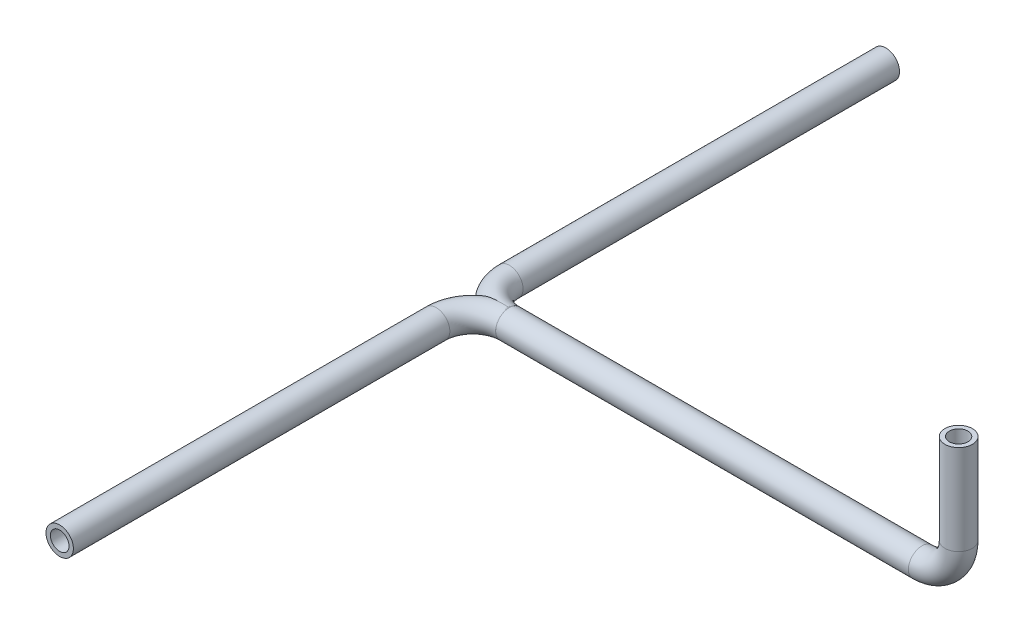
ISO-10303-21;
HEADER;
FILE_DESCRIPTION(('STEP AP214'),'2;1');
FILE_NAME('part.step','',(''),(''),'','','');
FILE_SCHEMA(('AUTOMOTIVE_DESIGN { 1 0 10303 214 1 1 1 1 }'));
ENDSEC;
DATA;
#1=APPLICATION_CONTEXT('core data for automotive mechanical design processes');
#2=APPLICATION_PROTOCOL_DEFINITION('international standard','automotive_design',2000,#1);
#3=PRODUCT_CONTEXT('',#1,'mechanical');
#4=PRODUCT('Part','Part','',(#3));
#5=PRODUCT_RELATED_PRODUCT_CATEGORY('part','',(#4));
#6=PRODUCT_DEFINITION_FORMATION('','',#4);
#7=PRODUCT_DEFINITION_CONTEXT('part definition',#1,'design');
#8=PRODUCT_DEFINITION('design','',#6,#7);
#9=PRODUCT_DEFINITION_SHAPE('','',#8);
#10=(LENGTH_UNIT() NAMED_UNIT(*) SI_UNIT(.MILLI.,.METRE.));
#11=(NAMED_UNIT(*) PLANE_ANGLE_UNIT() SI_UNIT($,.RADIAN.));
#12=(NAMED_UNIT(*) SI_UNIT($,.STERADIAN.) SOLID_ANGLE_UNIT());
#13=UNCERTAINTY_MEASURE_WITH_UNIT(LENGTH_MEASURE(1.E-05),#10,'distance_accuracy_value','');
#14=(GEOMETRIC_REPRESENTATION_CONTEXT(3) GLOBAL_UNCERTAINTY_ASSIGNED_CONTEXT((#13)) GLOBAL_UNIT_ASSIGNED_CONTEXT((#10,
#11,#12)) REPRESENTATION_CONTEXT('',''));
#15=CARTESIAN_POINT('',(0.,0.,0.));
#16=DIRECTION('',(0.,0.,1.));
#17=DIRECTION('',(1.,0.,0.));
#18=AXIS2_PLACEMENT_3D('',#15,#16,#17);
#19=CARTESIAN_POINT('',(-306.7,-86.5,-25.));
#20=DIRECTION('',(0.,-1.,0.));
#21=DIRECTION('',(0.,0.,-1.));
#22=AXIS2_PLACEMENT_3D('',#19,#20,#21);
#23=TOROIDAL_SURFACE('',#22,25.,9.35);
#24=CARTESIAN_POINT('',(-306.7,-86.5,0.));
#25=DIRECTION('',(-1.,0.,0.));
#26=DIRECTION('',(0.,-1.,0.));
#27=AXIS2_PLACEMENT_3D('',#24,#25,#26);
#28=CIRCLE('',#27,9.35);
#29=CARTESIAN_POINT('',(-306.7,-86.5,9.35));
#30=VERTEX_POINT('',#29);
#31=EDGE_CURVE('E70',#30,#30,#28,.T.);
#32=CARTESIAN_POINT('',(-331.7,-86.5,-25.));
#33=DIRECTION('',(0.,0.,-1.));
#34=DIRECTION('',(0.,-1.,0.));
#35=AXIS2_PLACEMENT_3D('',#32,#33,#34);
#36=CIRCLE('',#35,9.35);
#37=CARTESIAN_POINT('',(-341.05,-86.5,-25.));
#38=VERTEX_POINT('',#37);
#39=EDGE_CURVE('E55',#38,#38,#36,.T.);
#40=CARTESIAN_POINT('',(-306.7,-86.5,-25.));
#41=DIRECTION('',(0.,-1.,0.));
#42=DIRECTION('',(0.,0.,-1.));
#43=AXIS2_PLACEMENT_3D('',#40,#41,#42);
#44=CIRCLE('',#43,34.35);
#45=EDGE_CURVE('',#30,#38,#44,.T.);
#46=ORIENTED_EDGE('',*,*,#31,.T.);
#47=ORIENTED_EDGE('',*,*,#39,.F.);
#48=ORIENTED_EDGE('',*,*,#45,.T.);
#49=ORIENTED_EDGE('',*,*,#45,.F.);
#50=EDGE_LOOP('',(#46,#48,#47,#49));
#51=FACE_BOUND('',#50,.T.);
#52=ADVANCED_FACE('F51',(#51),#23,.T.);
#53=CARTESIAN_POINT('',(-331.7,-86.5,-25.));
#54=DIRECTION('',(0.,0.,-1.));
#55=DIRECTION('',(-1.,0.,0.));
#56=AXIS2_PLACEMENT_3D('',#53,#54,#55);
#57=CYLINDRICAL_SURFACE('',#56,9.35);
#58=CARTESIAN_POINT('',(-331.7,-86.5,-282.));
#59=DIRECTION('',(0.,0.,-1.));
#60=DIRECTION('',(0.,-1.,0.));
#61=AXIS2_PLACEMENT_3D('',#58,#59,#60);
#62=CIRCLE('',#61,9.35);
#63=CARTESIAN_POINT('',(-331.7,-95.85,-282.));
#64=VERTEX_POINT('',#63);
#65=EDGE_CURVE('E68',#64,#64,#62,.T.);
#66=ORIENTED_EDGE('',*,*,#65,.F.);
#67=EDGE_LOOP('',(#66));
#68=FACE_BOUND('',#67,.T.);
#69=ORIENTED_EDGE('',*,*,#39,.T.);
#70=EDGE_LOOP('',(#69));
#71=FACE_BOUND('',#70,.T.);
#72=ADVANCED_FACE('F53',(#68,#71),#57,.T.);
#73=CARTESIAN_POINT('',(-306.7,-86.5,0.));
#74=DIRECTION('',(-1.,0.,0.));
#75=DIRECTION('',(0.,-1.,0.));
#76=AXIS2_PLACEMENT_3D('',#73,#74,#75);
#77=PLANE('',#76);
#78=CARTESIAN_POINT('',(-306.7,-86.5,0.));
#79=DIRECTION('',(-1.,0.,0.));
#80=DIRECTION('',(0.,-1.,0.));
#81=AXIS2_PLACEMENT_3D('',#78,#79,#80);
#82=CIRCLE('',#81,6.35);
#83=CARTESIAN_POINT('',(-306.7,-86.5,6.34999999999999));
#84=VERTEX_POINT('',#83);
#85=EDGE_CURVE('E64',#84,#84,#82,.F.);
#86=ORIENTED_EDGE('',*,*,#85,.F.);
#87=EDGE_LOOP('',(#86));
#88=FACE_BOUND('',#87,.T.);
#89=ORIENTED_EDGE('',*,*,#31,.F.);
#90=EDGE_LOOP('',(#89));
#91=FACE_BOUND('',#90,.T.);
#92=ADVANCED_FACE('F82',(#88,#91),#77,.F.);
#93=CARTESIAN_POINT('',(-331.7,-86.5,-282.));
#94=DIRECTION('',(0.,0.,-1.));
#95=DIRECTION('',(0.,-1.,0.));
#96=AXIS2_PLACEMENT_3D('',#93,#94,#95);
#97=PLANE('',#96);
#98=CARTESIAN_POINT('',(-331.7,-86.5,-282.));
#99=DIRECTION('',(0.,0.,-1.));
#100=DIRECTION('',(0.,-1.,0.));
#101=AXIS2_PLACEMENT_3D('',#98,#99,#100);
#102=CIRCLE('',#101,6.35);
#103=CARTESIAN_POINT('',(-331.7,-92.85,-282.));
#104=VERTEX_POINT('',#103);
#105=EDGE_CURVE('E11',#104,#104,#102,.F.);
#106=ORIENTED_EDGE('',*,*,#105,.T.);
#107=EDGE_LOOP('',(#106));
#108=FACE_BOUND('',#107,.T.);
#109=ORIENTED_EDGE('',*,*,#65,.T.);
#110=EDGE_LOOP('',(#109));
#111=FACE_BOUND('',#110,.T.);
#112=ADVANCED_FACE('F93',(#108,#111),#97,.T.);
#113=CARTESIAN_POINT('',(-306.7,-86.5,-25.));
#114=DIRECTION('',(0.,-1.,0.));
#115=DIRECTION('',(0.,0.,-1.));
#116=AXIS2_PLACEMENT_3D('',#113,#114,#115);
#117=TOROIDAL_SURFACE('',#116,25.,6.35);
#118=CARTESIAN_POINT('',(-331.7,-86.5,-25.));
#119=DIRECTION('',(0.,0.,-1.));
#120=DIRECTION('',(0.,-1.,0.));
#121=AXIS2_PLACEMENT_3D('',#118,#119,#120);
#122=CIRCLE('',#121,6.35);
#123=CARTESIAN_POINT('',(-338.05,-86.5,-25.));
#124=VERTEX_POINT('',#123);
#125=EDGE_CURVE('E59',#124,#124,#122,.F.);
#126=CARTESIAN_POINT('',(-306.7,-86.5,-25.));
#127=DIRECTION('',(0.,-1.,0.));
#128=DIRECTION('',(0.,0.,-1.));
#129=AXIS2_PLACEMENT_3D('',#126,#127,#128);
#130=CIRCLE('',#129,31.35);
#131=EDGE_CURVE('',#84,#124,#130,.T.);
#132=ORIENTED_EDGE('',*,*,#85,.T.);
#133=ORIENTED_EDGE('',*,*,#125,.F.);
#134=ORIENTED_EDGE('',*,*,#131,.T.);
#135=ORIENTED_EDGE('',*,*,#131,.F.);
#136=EDGE_LOOP('',(#132,#134,#133,#135));
#137=FACE_BOUND('',#136,.T.);
#138=ADVANCED_FACE('F87',(#137),#117,.F.);
#139=CARTESIAN_POINT('',(-331.7,-86.5,-25.));
#140=DIRECTION('',(0.,0.,-1.));
#141=DIRECTION('',(-1.,0.,0.));
#142=AXIS2_PLACEMENT_3D('',#139,#140,#141);
#143=CYLINDRICAL_SURFACE('',#142,6.35);
#144=ORIENTED_EDGE('',*,*,#105,.F.);
#145=EDGE_LOOP('',(#144));
#146=FACE_BOUND('',#145,.T.);
#147=ORIENTED_EDGE('',*,*,#125,.T.);
#148=EDGE_LOOP('',(#147));
#149=FACE_BOUND('',#148,.T.);
#150=ADVANCED_FACE('F85',(#146,#149),#143,.F.);
#151=CLOSED_SHELL('',(#52,#72,#92,#112,#138,#150));
#152=MANIFOLD_SOLID_BREP('B2',#151);
#153=CARTESIAN_POINT('',(0.,0.,0.));
#154=DIRECTION('',(0.,-1.,0.));
#155=DIRECTION('',(1.,0.,0.));
#156=AXIS2_PLACEMENT_3D('',#153,#154,#155);
#157=CYLINDRICAL_SURFACE('',#156,9.35);
#158=CARTESIAN_POINT('',(0.,-61.5,0.));
#159=DIRECTION('',(0.,1.,0.));
#160=DIRECTION('',(0.,0.,1.));
#161=AXIS2_PLACEMENT_3D('',#158,#159,#160);
#162=CIRCLE('',#161,9.35);
#163=CARTESIAN_POINT('',(9.35000000000001,-61.5,0.));
#164=VERTEX_POINT('',#163);
#165=EDGE_CURVE('E162',#164,#164,#162,.T.);
#166=ORIENTED_EDGE('',*,*,#165,.T.);
#167=EDGE_LOOP('',(#166));
#168=FACE_BOUND('',#167,.T.);
#169=CARTESIAN_POINT('',(0.,0.,0.));
#170=DIRECTION('',(0.,1.,0.));
#171=DIRECTION('',(0.,0.,1.));
#172=AXIS2_PLACEMENT_3D('',#169,#170,#171);
#173=CIRCLE('',#172,9.35);
#174=CARTESIAN_POINT('',(0.,0.,9.35));
#175=VERTEX_POINT('',#174);
#176=EDGE_CURVE('E160',#175,#175,#173,.T.);
#177=ORIENTED_EDGE('',*,*,#176,.F.);
#178=EDGE_LOOP('',(#177));
#179=FACE_BOUND('',#178,.T.);
#180=ADVANCED_FACE('F143',(#168,#179),#157,.T.);
#181=CARTESIAN_POINT('',(-25.,-61.5,0.));
#182=DIRECTION('',(0.,0.,-1.));
#183=DIRECTION('',(-1.,0.,0.));
#184=AXIS2_PLACEMENT_3D('',#181,#182,#183);
#185=TOROIDAL_SURFACE('',#184,25.,9.35);
#186=CARTESIAN_POINT('',(-25.,-86.5,0.));
#187=DIRECTION('',(1.,0.,0.));
#188=DIRECTION('',(0.,0.,1.));
#189=AXIS2_PLACEMENT_3D('',#186,#187,#188);
#190=CIRCLE('',#189,9.35);
#191=CARTESIAN_POINT('',(-25.,-95.85,0.));
#192=VERTEX_POINT('',#191);
#193=EDGE_CURVE('E147',#192,#192,#190,.T.);
#194=CARTESIAN_POINT('',(-25.,-61.5,0.));
#195=DIRECTION('',(0.,0.,-1.));
#196=DIRECTION('',(-1.,0.,0.));
#197=AXIS2_PLACEMENT_3D('',#194,#195,#196);
#198=CIRCLE('',#197,34.35);
#199=EDGE_CURVE('',#164,#192,#198,.T.);
#200=ORIENTED_EDGE('',*,*,#165,.F.);
#201=ORIENTED_EDGE('',*,*,#193,.T.);
#202=ORIENTED_EDGE('',*,*,#199,.T.);
#203=ORIENTED_EDGE('',*,*,#199,.F.);
#204=EDGE_LOOP('',(#200,#202,#201,#203));
#205=FACE_BOUND('',#204,.T.);
#206=ADVANCED_FACE('F219',(#205),#185,.T.);
#207=CARTESIAN_POINT('',(-25.,-86.5,0.));
#208=DIRECTION('',(-1.,0.,0.));
#209=DIRECTION('',(0.,-1.,0.));
#210=AXIS2_PLACEMENT_3D('',#207,#208,#209);
#211=CYLINDRICAL_SURFACE('',#210,9.35);
#212=CARTESIAN_POINT('',(-306.7,-86.5,0.));
#213=DIRECTION('',(-1.,0.,0.));
#214=DIRECTION('',(0.,-1.,0.));
#215=AXIS2_PLACEMENT_3D('',#212,#213,#214);
#216=CIRCLE('',#215,9.35);
#217=CARTESIAN_POINT('',(-306.7,-86.5,-9.35));
#218=VERTEX_POINT('',#217);
#219=EDGE_CURVE('E181',#218,#218,#216,.T.);
#220=ORIENTED_EDGE('',*,*,#219,.F.);
#221=EDGE_LOOP('',(#220));
#222=FACE_BOUND('',#221,.T.);
#223=ORIENTED_EDGE('',*,*,#193,.F.);
#224=EDGE_LOOP('',(#223));
#225=FACE_BOUND('',#224,.T.);
#226=ADVANCED_FACE('F145',(#222,#225),#211,.T.);
#227=CARTESIAN_POINT('',(0.,0.,0.));
#228=DIRECTION('',(0.,1.,0.));
#229=DIRECTION('',(0.,0.,1.));
#230=AXIS2_PLACEMENT_3D('',#227,#228,#229);
#231=PLANE('',#230);
#232=CARTESIAN_POINT('',(0.,0.,0.));
#233=DIRECTION('',(0.,1.,0.));
#234=DIRECTION('',(0.,0.,1.));
#235=AXIS2_PLACEMENT_3D('',#232,#233,#234);
#236=CIRCLE('',#235,6.35);
#237=CARTESIAN_POINT('',(0.,0.,6.35));
#238=VERTEX_POINT('',#237);
#239=EDGE_CURVE('E156',#238,#238,#236,.F.);
#240=ORIENTED_EDGE('',*,*,#239,.T.);
#241=EDGE_LOOP('',(#240));
#242=FACE_BOUND('',#241,.T.);
#243=ORIENTED_EDGE('',*,*,#176,.T.);
#244=EDGE_LOOP('',(#243));
#245=FACE_BOUND('',#244,.T.);
#246=ADVANCED_FACE('F189',(#242,#245),#231,.T.);
#247=CARTESIAN_POINT('',(0.,0.,0.));
#248=DIRECTION('',(0.,-1.,0.));
#249=DIRECTION('',(1.,0.,0.));
#250=AXIS2_PLACEMENT_3D('',#247,#248,#249);
#251=CYLINDRICAL_SURFACE('',#250,6.35);
#252=CARTESIAN_POINT('',(0.,-61.5,0.));
#253=DIRECTION('',(0.,1.,0.));
#254=DIRECTION('',(0.,0.,1.));
#255=AXIS2_PLACEMENT_3D('',#252,#253,#254);
#256=CIRCLE('',#255,6.35);
#257=CARTESIAN_POINT('',(6.35000000000001,-61.5,0.));
#258=VERTEX_POINT('',#257);
#259=EDGE_CURVE('E151',#258,#258,#256,.F.);
#260=ORIENTED_EDGE('',*,*,#259,.T.);
#261=EDGE_LOOP('',(#260));
#262=FACE_BOUND('',#261,.T.);
#263=ORIENTED_EDGE('',*,*,#239,.F.);
#264=EDGE_LOOP('',(#263));
#265=FACE_BOUND('',#264,.T.);
#266=ADVANCED_FACE('F192',(#262,#265),#251,.F.);
#267=CARTESIAN_POINT('',(-25.,-61.5,0.));
#268=DIRECTION('',(0.,0.,-1.));
#269=DIRECTION('',(-1.,0.,0.));
#270=AXIS2_PLACEMENT_3D('',#267,#268,#269);
#271=TOROIDAL_SURFACE('',#270,25.,6.35);
#272=CARTESIAN_POINT('',(-25.,-86.5,0.));
#273=DIRECTION('',(1.,0.,0.));
#274=DIRECTION('',(0.,0.,1.));
#275=AXIS2_PLACEMENT_3D('',#272,#273,#274);
#276=CIRCLE('',#275,6.35);
#277=CARTESIAN_POINT('',(-25.,-92.85,0.));
#278=VERTEX_POINT('',#277);
#279=EDGE_CURVE('E50',#278,#278,#276,.F.);
#280=CARTESIAN_POINT('',(-25.,-61.5,0.));
#281=DIRECTION('',(0.,0.,-1.));
#282=DIRECTION('',(-1.,0.,0.));
#283=AXIS2_PLACEMENT_3D('',#280,#281,#282);
#284=CIRCLE('',#283,31.35);
#285=EDGE_CURVE('',#258,#278,#284,.T.);
#286=ORIENTED_EDGE('',*,*,#259,.F.);
#287=ORIENTED_EDGE('',*,*,#279,.T.);
#288=ORIENTED_EDGE('',*,*,#285,.T.);
#289=ORIENTED_EDGE('',*,*,#285,.F.);
#290=EDGE_LOOP('',(#286,#288,#287,#289));
#291=FACE_BOUND('',#290,.T.);
#292=ADVANCED_FACE('F194',(#291),#271,.F.);
#293=CARTESIAN_POINT('',(-25.,-86.5,0.));
#294=DIRECTION('',(-1.,0.,0.));
#295=DIRECTION('',(0.,-1.,0.));
#296=AXIS2_PLACEMENT_3D('',#293,#294,#295);
#297=CYLINDRICAL_SURFACE('',#296,6.35);
#298=CARTESIAN_POINT('',(-306.7,-86.5,0.));
#299=DIRECTION('',(-1.,0.,0.));
#300=DIRECTION('',(0.,-1.,0.));
#301=AXIS2_PLACEMENT_3D('',#298,#299,#300);
#302=CIRCLE('',#301,6.35);
#303=CARTESIAN_POINT('',(-306.7,-86.5,-6.34999999999999));
#304=VERTEX_POINT('',#303);
#305=EDGE_CURVE('E174',#304,#304,#302,.F.);
#306=ORIENTED_EDGE('',*,*,#305,.F.);
#307=EDGE_LOOP('',(#306));
#308=FACE_BOUND('',#307,.T.);
#309=ORIENTED_EDGE('',*,*,#279,.F.);
#310=EDGE_LOOP('',(#309));
#311=FACE_BOUND('',#310,.T.);
#312=ADVANCED_FACE('F201',(#308,#311),#297,.F.);
#313=CARTESIAN_POINT('',(-306.7,-86.5,25.));
#314=DIRECTION('',(0.,1.,0.));
#315=DIRECTION('',(0.,0.,1.));
#316=AXIS2_PLACEMENT_3D('',#313,#314,#315);
#317=TOROIDAL_SURFACE('',#316,25.,9.35);
#318=CARTESIAN_POINT('',(-331.7,-86.5,25.));
#319=DIRECTION('',(0.,0.,1.));
#320=DIRECTION('',(0.,-1.,0.));
#321=AXIS2_PLACEMENT_3D('',#318,#319,#320);
#322=CIRCLE('',#321,9.35);
#323=CARTESIAN_POINT('',(-341.05,-86.5,25.));
#324=VERTEX_POINT('',#323);
#325=EDGE_CURVE('E184',#324,#324,#322,.T.);
#326=CARTESIAN_POINT('',(-306.7,-86.5,25.));
#327=DIRECTION('',(0.,1.,0.));
#328=DIRECTION('',(0.,0.,1.));
#329=AXIS2_PLACEMENT_3D('',#326,#327,#328);
#330=CIRCLE('',#329,34.35);
#331=EDGE_CURVE('',#218,#324,#330,.T.);
#332=ORIENTED_EDGE('',*,*,#219,.T.);
#333=ORIENTED_EDGE('',*,*,#325,.F.);
#334=ORIENTED_EDGE('',*,*,#331,.T.);
#335=ORIENTED_EDGE('',*,*,#331,.F.);
#336=EDGE_LOOP('',(#332,#334,#333,#335));
#337=FACE_BOUND('',#336,.T.);
#338=ADVANCED_FACE('F206',(#337),#317,.T.);
#339=CARTESIAN_POINT('',(-331.7,-86.5,25.));
#340=DIRECTION('',(0.,0.,1.));
#341=DIRECTION('',(1.,0.,0.));
#342=AXIS2_PLACEMENT_3D('',#339,#340,#341);
#343=CYLINDRICAL_SURFACE('',#342,9.35);
#344=CARTESIAN_POINT('',(-331.7,-86.5,282.));
#345=DIRECTION('',(0.,0.,1.));
#346=DIRECTION('',(0.,-1.,0.));
#347=AXIS2_PLACEMENT_3D('',#344,#345,#346);
#348=CIRCLE('',#347,9.35);
#349=CARTESIAN_POINT('',(-331.7,-95.85,282.));
#350=VERTEX_POINT('',#349);
#351=EDGE_CURVE('E178',#350,#350,#348,.T.);
#352=ORIENTED_EDGE('',*,*,#351,.F.);
#353=EDGE_LOOP('',(#352));
#354=FACE_BOUND('',#353,.T.);
#355=ORIENTED_EDGE('',*,*,#325,.T.);
#356=EDGE_LOOP('',(#355));
#357=FACE_BOUND('',#356,.T.);
#358=ADVANCED_FACE('F212',(#354,#357),#343,.T.);
#359=CARTESIAN_POINT('',(-331.7,-86.5,282.));
#360=DIRECTION('',(0.,0.,1.));
#361=DIRECTION('',(0.,-1.,0.));
#362=AXIS2_PLACEMENT_3D('',#359,#360,#361);
#363=PLANE('',#362);
#364=CARTESIAN_POINT('',(-331.7,-86.5,282.));
#365=DIRECTION('',(0.,0.,1.));
#366=DIRECTION('',(0.,-1.,0.));
#367=AXIS2_PLACEMENT_3D('',#364,#365,#366);
#368=CIRCLE('',#367,6.35);
#369=CARTESIAN_POINT('',(-331.7,-92.85,282.));
#370=VERTEX_POINT('',#369);
#371=EDGE_CURVE('E164',#370,#370,#368,.F.);
#372=ORIENTED_EDGE('',*,*,#371,.T.);
#373=EDGE_LOOP('',(#372));
#374=FACE_BOUND('',#373,.T.);
#375=ORIENTED_EDGE('',*,*,#351,.T.);
#376=EDGE_LOOP('',(#375));
#377=FACE_BOUND('',#376,.T.);
#378=ADVANCED_FACE('F269',(#374,#377),#363,.T.);
#379=CARTESIAN_POINT('',(-306.7,-86.5,25.));
#380=DIRECTION('',(0.,1.,0.));
#381=DIRECTION('',(0.,0.,1.));
#382=AXIS2_PLACEMENT_3D('',#379,#380,#381);
#383=TOROIDAL_SURFACE('',#382,25.,6.35);
#384=CARTESIAN_POINT('',(-331.7,-86.5,25.));
#385=DIRECTION('',(0.,0.,1.));
#386=DIRECTION('',(0.,-1.,0.));
#387=AXIS2_PLACEMENT_3D('',#384,#385,#386);
#388=CIRCLE('',#387,6.35);
#389=CARTESIAN_POINT('',(-338.05,-86.5,25.));
#390=VERTEX_POINT('',#389);
#391=EDGE_CURVE('E169',#390,#390,#388,.F.);
#392=CARTESIAN_POINT('',(-306.7,-86.5,25.));
#393=DIRECTION('',(0.,1.,0.));
#394=DIRECTION('',(0.,0.,1.));
#395=AXIS2_PLACEMENT_3D('',#392,#393,#394);
#396=CIRCLE('',#395,31.35);
#397=EDGE_CURVE('',#304,#390,#396,.T.);
#398=ORIENTED_EDGE('',*,*,#305,.T.);
#399=ORIENTED_EDGE('',*,*,#391,.F.);
#400=ORIENTED_EDGE('',*,*,#397,.T.);
#401=ORIENTED_EDGE('',*,*,#397,.F.);
#402=EDGE_LOOP('',(#398,#400,#399,#401));
#403=FACE_BOUND('',#402,.T.);
#404=ADVANCED_FACE('F278',(#403),#383,.F.);
#405=CARTESIAN_POINT('',(-331.7,-86.5,25.));
#406=DIRECTION('',(0.,0.,1.));
#407=DIRECTION('',(1.,0.,0.));
#408=AXIS2_PLACEMENT_3D('',#405,#406,#407);
#409=CYLINDRICAL_SURFACE('',#408,6.35);
#410=ORIENTED_EDGE('',*,*,#371,.F.);
#411=EDGE_LOOP('',(#410));
#412=FACE_BOUND('',#411,.T.);
#413=ORIENTED_EDGE('',*,*,#391,.T.);
#414=EDGE_LOOP('',(#413));
#415=FACE_BOUND('',#414,.T.);
#416=ADVANCED_FACE('F220',(#412,#415),#409,.F.);
#417=CLOSED_SHELL('',(#180,#206,#226,#246,#266,#292,#312,#338,#358,#378,#404,#416));
#418=MANIFOLD_SOLID_BREP('B6',#417);
#419=ADVANCED_BREP_SHAPE_REPRESENTATION('',(#18,#152,#418),#14);
#420=SHAPE_DEFINITION_REPRESENTATION(#9,#419);
ENDSEC;
END-ISO-10303-21;
